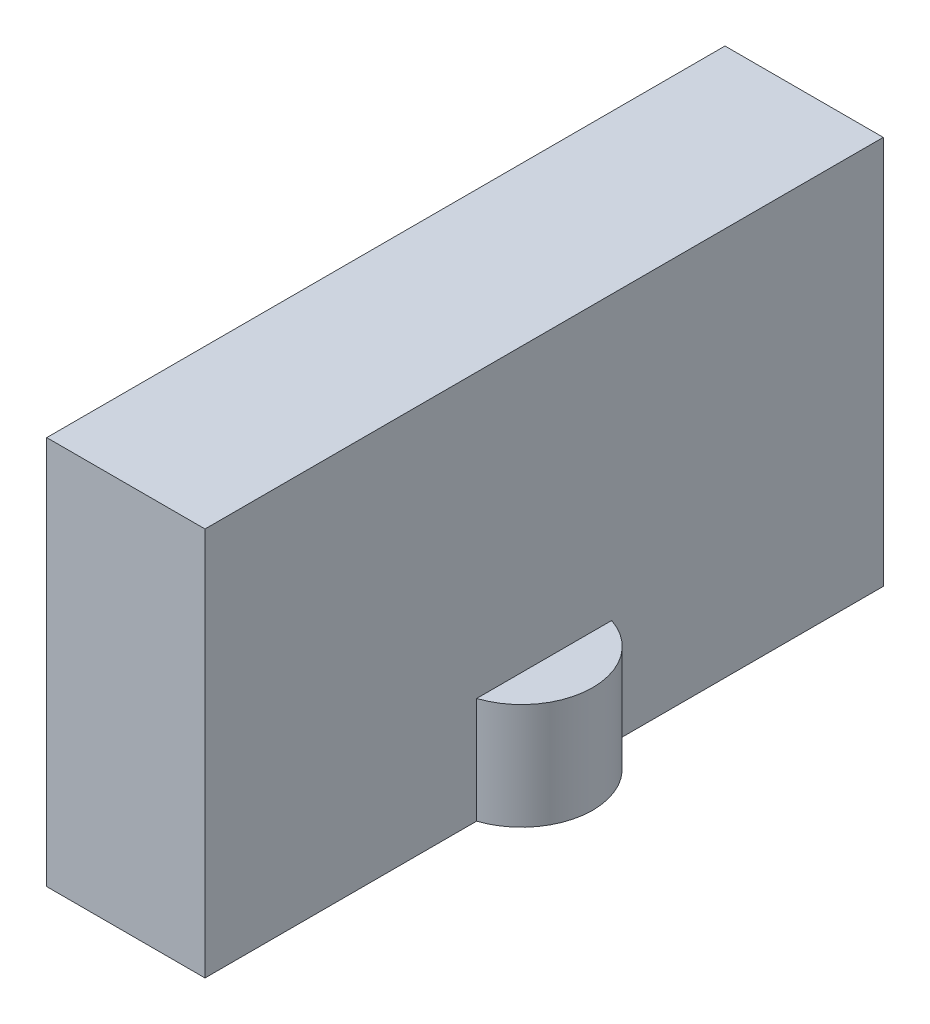
ISO-10303-21;
HEADER;
FILE_DESCRIPTION(('STEP AP214'),'2;1');
FILE_NAME('part.step','',(''),(''),'','','');
FILE_SCHEMA(('AUTOMOTIVE_DESIGN { 1 0 10303 214 1 1 1 1 }'));
ENDSEC;
DATA;
#1=APPLICATION_CONTEXT('core data for automotive mechanical design processes');
#2=APPLICATION_PROTOCOL_DEFINITION('international standard','automotive_design',2000,#1);
#3=PRODUCT_CONTEXT('',#1,'mechanical');
#4=PRODUCT('Part','Part','',(#3));
#5=PRODUCT_RELATED_PRODUCT_CATEGORY('part','',(#4));
#6=PRODUCT_DEFINITION_FORMATION('','',#4);
#7=PRODUCT_DEFINITION_CONTEXT('part definition',#1,'design');
#8=PRODUCT_DEFINITION('design','',#6,#7);
#9=PRODUCT_DEFINITION_SHAPE('','',#8);
#10=(LENGTH_UNIT() NAMED_UNIT(*) SI_UNIT(.MILLI.,.METRE.));
#11=(NAMED_UNIT(*) PLANE_ANGLE_UNIT() SI_UNIT($,.RADIAN.));
#12=(NAMED_UNIT(*) SI_UNIT($,.STERADIAN.) SOLID_ANGLE_UNIT());
#13=UNCERTAINTY_MEASURE_WITH_UNIT(LENGTH_MEASURE(1.E-05),#10,'distance_accuracy_value','');
#14=(GEOMETRIC_REPRESENTATION_CONTEXT(3) GLOBAL_UNCERTAINTY_ASSIGNED_CONTEXT((#13)) GLOBAL_UNIT_ASSIGNED_CONTEXT((#10,
#11,#12)) REPRESENTATION_CONTEXT('',''));
#15=CARTESIAN_POINT('',(0.,0.,0.));
#16=DIRECTION('',(0.,0.,1.));
#17=DIRECTION('',(1.,0.,0.));
#18=AXIS2_PLACEMENT_3D('',#15,#16,#17);
#19=CARTESIAN_POINT('',(0.,170.,0.));
#20=DIRECTION('',(0.,-1.,0.));
#21=DIRECTION('',(0.,0.,-1.));
#22=AXIS2_PLACEMENT_3D('',#19,#20,#21);
#23=CYLINDRICAL_SURFACE('',#22,31.5);
#24=CARTESIAN_POINT('',(0.,123.,0.));
#25=DIRECTION('',(0.,-1.,0.));
#26=DIRECTION('',(0.,0.,-1.));
#27=AXIS2_PLACEMENT_3D('',#24,#25,#26);
#28=CIRCLE('',#27,31.5);
#29=CARTESIAN_POINT('',(10.,123.,-29.8705540624877));
#30=VERTEX_POINT('',#29);
#31=CARTESIAN_POINT('',(10.,123.,29.8705540624877));
#32=VERTEX_POINT('',#31);
#33=EDGE_CURVE('E121',#30,#32,#28,.T.);
#34=ORIENTED_EDGE('',*,*,#33,.F.);
#35=DIRECTION('',(0.,-1.,0.));
#36=VECTOR('',#35,1.);
#37=CARTESIAN_POINT('',(10.,170.,-29.8705540624877));
#38=LINE('',#37,#36);
#39=CARTESIAN_POINT('',(10.,170.,-29.8705540624877));
#40=VERTEX_POINT('',#39);
#41=EDGE_CURVE('E110',#40,#30,#38,.T.);
#42=ORIENTED_EDGE('',*,*,#41,.F.);
#43=CARTESIAN_POINT('',(0.,170.,0.));
#44=DIRECTION('',(0.,1.,0.));
#45=DIRECTION('',(0.,0.,1.));
#46=AXIS2_PLACEMENT_3D('',#43,#44,#45);
#47=CIRCLE('',#46,31.5);
#48=CARTESIAN_POINT('',(10.,170.,29.8705540624877));
#49=VERTEX_POINT('',#48);
#50=EDGE_CURVE('E113',#49,#40,#47,.T.);
#51=ORIENTED_EDGE('',*,*,#50,.F.);
#52=DIRECTION('',(0.,-1.,0.));
#53=VECTOR('',#52,1.);
#54=CARTESIAN_POINT('',(10.,170.,29.8705540624877));
#55=LINE('',#54,#53);
#56=EDGE_CURVE('E54',#32,#49,#55,.F.);
#57=ORIENTED_EDGE('',*,*,#56,.F.);
#58=EDGE_LOOP('',(#34,#42,#51,#57));
#59=FACE_BOUND('',#58,.T.);
#60=ADVANCED_FACE('F34',(#59),#23,.T.);
#61=CARTESIAN_POINT('',(10.,295.,0.));
#62=DIRECTION('',(-1.,0.,0.));
#63=DIRECTION('',(0.,0.,1.));
#64=AXIS2_PLACEMENT_3D('',#61,#62,#63);
#65=PLANE('',#64);
#66=DIRECTION('',(0.,0.,1.));
#67=VECTOR('',#66,1.);
#68=CARTESIAN_POINT('',(10.,123.,0.));
#69=LINE('',#68,#67);
#70=CARTESIAN_POINT('',(10.,123.,-150.));
#71=VERTEX_POINT('',#70);
#72=EDGE_CURVE('E125',#71,#30,#69,.T.);
#73=ORIENTED_EDGE('',*,*,#72,.F.);
#74=DIRECTION('',(0.,-1.,0.));
#75=VECTOR('',#74,1.);
#76=CARTESIAN_POINT('',(10.,295.,-150.));
#77=LINE('',#76,#75);
#78=CARTESIAN_POINT('',(10.,295.,-150.));
#79=VERTEX_POINT('',#78);
#80=EDGE_CURVE('E105',#79,#71,#77,.T.);
#81=ORIENTED_EDGE('',*,*,#80,.F.);
#82=DIRECTION('',(0.,0.,-1.));
#83=VECTOR('',#82,1.);
#84=CARTESIAN_POINT('',(10.,295.,0.));
#85=LINE('',#84,#83);
#86=CARTESIAN_POINT('',(9.99999999999999,295.,150.));
#87=VERTEX_POINT('',#86);
#88=EDGE_CURVE('E134',#87,#79,#85,.T.);
#89=ORIENTED_EDGE('',*,*,#88,.F.);
#90=DIRECTION('',(0.,-1.,0.));
#91=VECTOR('',#90,1.);
#92=CARTESIAN_POINT('',(9.99999999999999,295.,150.));
#93=LINE('',#92,#91);
#94=CARTESIAN_POINT('',(9.99999999999999,123.,150.));
#95=VERTEX_POINT('',#94);
#96=EDGE_CURVE('E102',#87,#95,#93,.T.);
#97=ORIENTED_EDGE('',*,*,#96,.T.);
#98=EDGE_CURVE('E47',#32,#95,#69,.T.);
#99=ORIENTED_EDGE('',*,*,#98,.F.);
#100=ORIENTED_EDGE('',*,*,#56,.T.);
#101=DIRECTION('',(0.,0.,1.));
#102=VECTOR('',#101,1.);
#103=CARTESIAN_POINT('',(10.,170.,0.));
#104=LINE('',#103,#102);
#105=EDGE_CURVE('E41',#40,#49,#104,.T.);
#106=ORIENTED_EDGE('',*,*,#105,.F.);
#107=ORIENTED_EDGE('',*,*,#41,.T.);
#108=EDGE_LOOP('',(#73,#81,#89,#97,#99,#100,#106,#107));
#109=FACE_BOUND('',#108,.T.);
#110=ADVANCED_FACE('F123',(#109),#65,.F.);
#111=CARTESIAN_POINT('',(0.,295.,-150.));
#112=DIRECTION('',(0.,0.,-1.));
#113=DIRECTION('',(-1.,0.,0.));
#114=AXIS2_PLACEMENT_3D('',#111,#112,#113);
#115=PLANE('',#114);
#116=ORIENTED_EDGE('',*,*,#80,.T.);
#117=DIRECTION('',(-1.,0.,0.));
#118=VECTOR('',#117,1.);
#119=CARTESIAN_POINT('',(0.,123.,-150.));
#120=LINE('',#119,#118);
#121=CARTESIAN_POINT('',(-60.,123.,-150.));
#122=VERTEX_POINT('',#121);
#123=EDGE_CURVE('E98',#71,#122,#120,.T.);
#124=ORIENTED_EDGE('',*,*,#123,.T.);
#125=DIRECTION('',(0.,-1.,0.));
#126=VECTOR('',#125,1.);
#127=CARTESIAN_POINT('',(-60.,295.,-150.));
#128=LINE('',#127,#126);
#129=CARTESIAN_POINT('',(-60.,295.,-150.));
#130=VERTEX_POINT('',#129);
#131=EDGE_CURVE('E97',#130,#122,#128,.T.);
#132=ORIENTED_EDGE('',*,*,#131,.F.);
#133=DIRECTION('',(1.,0.,0.));
#134=VECTOR('',#133,1.);
#135=CARTESIAN_POINT('',(0.,295.,-150.));
#136=LINE('',#135,#134);
#137=EDGE_CURVE('E133',#130,#79,#136,.T.);
#138=ORIENTED_EDGE('',*,*,#137,.T.);
#139=EDGE_LOOP('',(#116,#124,#132,#138));
#140=FACE_BOUND('',#139,.T.);
#141=ADVANCED_FACE('F131',(#140),#115,.T.);
#142=CARTESIAN_POINT('',(-60.,295.,0.));
#143=DIRECTION('',(1.,0.,0.));
#144=DIRECTION('',(0.,0.,-1.));
#145=AXIS2_PLACEMENT_3D('',#142,#143,#144);
#146=PLANE('',#145);
#147=DIRECTION('',(0.,0.,-1.));
#148=VECTOR('',#147,1.);
#149=CARTESIAN_POINT('',(-60.,123.,0.));
#150=LINE('',#149,#148);
#151=CARTESIAN_POINT('',(-60.,123.,150.));
#152=VERTEX_POINT('',#151);
#153=EDGE_CURVE('E84',#152,#122,#150,.T.);
#154=ORIENTED_EDGE('',*,*,#153,.F.);
#155=DIRECTION('',(0.,-1.,0.));
#156=VECTOR('',#155,1.);
#157=CARTESIAN_POINT('',(-60.,295.,150.));
#158=LINE('',#157,#156);
#159=CARTESIAN_POINT('',(-60.,295.,150.));
#160=VERTEX_POINT('',#159);
#161=EDGE_CURVE('E95',#160,#152,#158,.T.);
#162=ORIENTED_EDGE('',*,*,#161,.F.);
#163=DIRECTION('',(0.,0.,1.));
#164=VECTOR('',#163,1.);
#165=CARTESIAN_POINT('',(-60.,295.,0.));
#166=LINE('',#165,#164);
#167=EDGE_CURVE('E138',#130,#160,#166,.T.);
#168=ORIENTED_EDGE('',*,*,#167,.F.);
#169=ORIENTED_EDGE('',*,*,#131,.T.);
#170=EDGE_LOOP('',(#154,#162,#168,#169));
#171=FACE_BOUND('',#170,.T.);
#172=ADVANCED_FACE('F93',(#171),#146,.F.);
#173=CARTESIAN_POINT('',(0.,295.,150.));
#174=DIRECTION('',(0.,0.,-1.));
#175=DIRECTION('',(-1.,0.,0.));
#176=AXIS2_PLACEMENT_3D('',#173,#174,#175);
#177=PLANE('',#176);
#178=DIRECTION('',(-1.,0.,0.));
#179=VECTOR('',#178,1.);
#180=CARTESIAN_POINT('',(0.,123.,150.));
#181=LINE('',#180,#179);
#182=EDGE_CURVE('E11',#95,#152,#181,.T.);
#183=ORIENTED_EDGE('',*,*,#182,.F.);
#184=ORIENTED_EDGE('',*,*,#96,.F.);
#185=DIRECTION('',(1.,0.,0.));
#186=VECTOR('',#185,1.);
#187=CARTESIAN_POINT('',(0.,295.,150.));
#188=LINE('',#187,#186);
#189=EDGE_CURVE('E101',#160,#87,#188,.T.);
#190=ORIENTED_EDGE('',*,*,#189,.F.);
#191=ORIENTED_EDGE('',*,*,#161,.T.);
#192=EDGE_LOOP('',(#183,#184,#190,#191));
#193=FACE_BOUND('',#192,.T.);
#194=ADVANCED_FACE('F100',(#193),#177,.F.);
#195=CARTESIAN_POINT('',(0.,170.,0.));
#196=DIRECTION('',(0.,1.,0.));
#197=DIRECTION('',(0.,0.,1.));
#198=AXIS2_PLACEMENT_3D('',#195,#196,#197);
#199=PLANE('',#198);
#200=ORIENTED_EDGE('',*,*,#50,.T.);
#201=ORIENTED_EDGE('',*,*,#105,.T.);
#202=EDGE_LOOP('',(#200,#201));
#203=FACE_BOUND('',#202,.T.);
#204=ADVANCED_FACE('F117',(#203),#199,.T.);
#205=CARTESIAN_POINT('',(0.,295.,0.));
#206=DIRECTION('',(0.,1.,0.));
#207=DIRECTION('',(0.,0.,1.));
#208=AXIS2_PLACEMENT_3D('',#205,#206,#207);
#209=PLANE('',#208);
#210=ORIENTED_EDGE('',*,*,#137,.F.);
#211=ORIENTED_EDGE('',*,*,#167,.T.);
#212=ORIENTED_EDGE('',*,*,#189,.T.);
#213=ORIENTED_EDGE('',*,*,#88,.T.);
#214=EDGE_LOOP('',(#210,#211,#212,#213));
#215=FACE_BOUND('',#214,.T.);
#216=ADVANCED_FACE('F143',(#215),#209,.T.);
#217=CARTESIAN_POINT('',(0.,123.,0.));
#218=DIRECTION('',(0.,-1.,0.));
#219=DIRECTION('',(0.,0.,-1.));
#220=AXIS2_PLACEMENT_3D('',#217,#218,#219);
#221=PLANE('',#220);
#222=ORIENTED_EDGE('',*,*,#33,.T.);
#223=ORIENTED_EDGE('',*,*,#98,.T.);
#224=ORIENTED_EDGE('',*,*,#182,.T.);
#225=ORIENTED_EDGE('',*,*,#153,.T.);
#226=ORIENTED_EDGE('',*,*,#123,.F.);
#227=ORIENTED_EDGE('',*,*,#72,.T.);
#228=EDGE_LOOP('',(#222,#223,#224,#225,#226,#227));
#229=FACE_BOUND('',#228,.T.);
#230=ADVANCED_FACE('F83',(#229),#221,.T.);
#231=CLOSED_SHELL('',(#60,#110,#141,#172,#194,#204,#216,#230));
#232=MANIFOLD_SOLID_BREP('B2',#231);
#233=ADVANCED_BREP_SHAPE_REPRESENTATION('',(#18,#232),#14);
#234=SHAPE_DEFINITION_REPRESENTATION(#9,#233);
ENDSEC;
END-ISO-10303-21;
